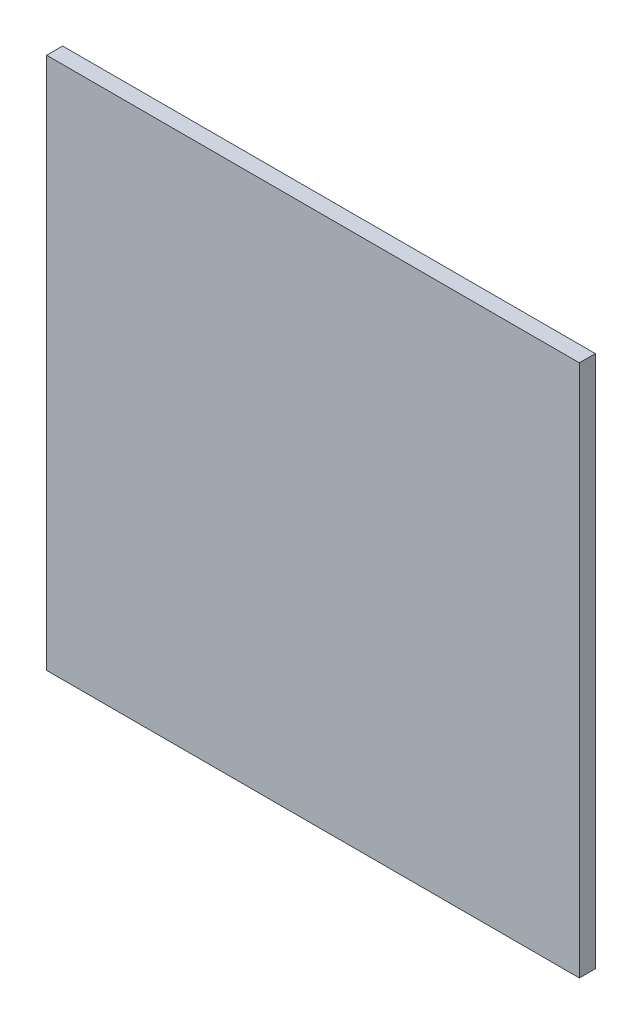
ISO-10303-21;
HEADER;
FILE_DESCRIPTION(('STEP AP214'),'2;1');
FILE_NAME('part.step','',(''),(''),'','','');
FILE_SCHEMA(('AUTOMOTIVE_DESIGN { 1 0 10303 214 1 1 1 1 }'));
ENDSEC;
DATA;
#1=APPLICATION_CONTEXT('core data for automotive mechanical design processes');
#2=APPLICATION_PROTOCOL_DEFINITION('international standard','automotive_design',2000,#1);
#3=PRODUCT_CONTEXT('',#1,'mechanical');
#4=PRODUCT('Part','Part','',(#3));
#5=PRODUCT_RELATED_PRODUCT_CATEGORY('part','',(#4));
#6=PRODUCT_DEFINITION_FORMATION('','',#4);
#7=PRODUCT_DEFINITION_CONTEXT('part definition',#1,'design');
#8=PRODUCT_DEFINITION('design','',#6,#7);
#9=PRODUCT_DEFINITION_SHAPE('','',#8);
#10=(LENGTH_UNIT() NAMED_UNIT(*) SI_UNIT(.MILLI.,.METRE.));
#11=(NAMED_UNIT(*) PLANE_ANGLE_UNIT() SI_UNIT($,.RADIAN.));
#12=(NAMED_UNIT(*) SI_UNIT($,.STERADIAN.) SOLID_ANGLE_UNIT());
#13=UNCERTAINTY_MEASURE_WITH_UNIT(LENGTH_MEASURE(1.E-05),#10,'distance_accuracy_value','');
#14=(GEOMETRIC_REPRESENTATION_CONTEXT(3) GLOBAL_UNCERTAINTY_ASSIGNED_CONTEXT((#13)) GLOBAL_UNIT_ASSIGNED_CONTEXT((#10,
#11,#12)) REPRESENTATION_CONTEXT('',''));
#15=CARTESIAN_POINT('',(0.,0.,0.));
#16=DIRECTION('',(0.,0.,1.));
#17=DIRECTION('',(1.,0.,0.));
#18=AXIS2_PLACEMENT_3D('',#15,#16,#17);
#19=CARTESIAN_POINT('',(73.9689060755339,-106.292457263354,3.));
#20=DIRECTION('',(0.,1.,0.));
#21=DIRECTION('',(-1.,0.,0.));
#22=AXIS2_PLACEMENT_3D('',#19,#20,#21);
#23=PLANE('',#22);
#24=DIRECTION('',(1.,0.,0.));
#25=VECTOR('',#24,1.);
#26=CARTESIAN_POINT('',(73.9689060755339,-106.292457263354,0.));
#27=LINE('',#26,#25);
#28=CARTESIAN_POINT('',(-26.0310939244661,-106.292457263354,0.));
#29=VERTEX_POINT('',#28);
#30=CARTESIAN_POINT('',(73.9689060755339,-106.292457263354,0.));
#31=VERTEX_POINT('',#30);
#32=EDGE_CURVE('E107',#29,#31,#27,.T.);
#33=ORIENTED_EDGE('',*,*,#32,.T.);
#34=DIRECTION('',(0.,0.,-1.));
#35=VECTOR('',#34,1.);
#36=CARTESIAN_POINT('',(73.9689060755339,-106.292457263354,3.));
#37=LINE('',#36,#35);
#38=CARTESIAN_POINT('',(73.9689060755339,-106.292457263354,3.));
#39=VERTEX_POINT('',#38);
#40=EDGE_CURVE('E11',#39,#31,#37,.T.);
#41=ORIENTED_EDGE('',*,*,#40,.F.);
#42=DIRECTION('',(1.,0.,0.));
#43=VECTOR('',#42,1.);
#44=CARTESIAN_POINT('',(73.9689060755339,-106.292457263354,3.));
#45=LINE('',#44,#43);
#46=CARTESIAN_POINT('',(-26.0310939244661,-106.292457263354,3.));
#47=VERTEX_POINT('',#46);
#48=EDGE_CURVE('E91',#47,#39,#45,.T.);
#49=ORIENTED_EDGE('',*,*,#48,.F.);
#50=DIRECTION('',(0.,0.,-1.));
#51=VECTOR('',#50,1.);
#52=CARTESIAN_POINT('',(-26.0310939244661,-106.292457263354,3.));
#53=LINE('',#52,#51);
#54=EDGE_CURVE('E103',#47,#29,#53,.T.);
#55=ORIENTED_EDGE('',*,*,#54,.T.);
#56=EDGE_LOOP('',(#33,#41,#49,#55));
#57=FACE_BOUND('',#56,.T.);
#58=ADVANCED_FACE('F39',(#57),#23,.F.);
#59=CARTESIAN_POINT('',(73.9689060755339,-6.29245726335448,3.));
#60=DIRECTION('',(-1.,0.,0.));
#61=DIRECTION('',(0.,-1.,0.));
#62=AXIS2_PLACEMENT_3D('',#59,#60,#61);
#63=PLANE('',#62);
#64=DIRECTION('',(0.,1.,0.));
#65=VECTOR('',#64,1.);
#66=CARTESIAN_POINT('',(73.9689060755339,-6.29245726335448,0.));
#67=LINE('',#66,#65);
#68=CARTESIAN_POINT('',(73.9689060755339,-6.29245726335448,0.));
#69=VERTEX_POINT('',#68);
#70=EDGE_CURVE('E96',#31,#69,#67,.T.);
#71=ORIENTED_EDGE('',*,*,#70,.T.);
#72=DIRECTION('',(0.,0.,-1.));
#73=VECTOR('',#72,1.);
#74=CARTESIAN_POINT('',(73.9689060755339,-6.29245726335448,3.));
#75=LINE('',#74,#73);
#76=CARTESIAN_POINT('',(73.9689060755339,-6.29245726335448,3.));
#77=VERTEX_POINT('',#76);
#78=EDGE_CURVE('E48',#77,#69,#75,.T.);
#79=ORIENTED_EDGE('',*,*,#78,.F.);
#80=DIRECTION('',(0.,1.,0.));
#81=VECTOR('',#80,1.);
#82=CARTESIAN_POINT('',(73.9689060755339,-6.29245726335448,3.));
#83=LINE('',#82,#81);
#84=EDGE_CURVE('E86',#39,#77,#83,.T.);
#85=ORIENTED_EDGE('',*,*,#84,.F.);
#86=ORIENTED_EDGE('',*,*,#40,.T.);
#87=EDGE_LOOP('',(#71,#79,#85,#86));
#88=FACE_BOUND('',#87,.T.);
#89=ADVANCED_FACE('F95',(#88),#63,.F.);
#90=CARTESIAN_POINT('',(-26.0310939244661,-6.29245726335448,3.));
#91=DIRECTION('',(0.,-1.,0.));
#92=DIRECTION('',(0.,0.,-1.));
#93=AXIS2_PLACEMENT_3D('',#90,#91,#92);
#94=PLANE('',#93);
#95=DIRECTION('',(-1.,0.,0.));
#96=VECTOR('',#95,1.);
#97=CARTESIAN_POINT('',(-26.0310939244661,-6.29245726335448,0.));
#98=LINE('',#97,#96);
#99=CARTESIAN_POINT('',(-26.0310939244661,-6.29245726335448,0.));
#100=VERTEX_POINT('',#99);
#101=EDGE_CURVE('E73',#69,#100,#98,.T.);
#102=ORIENTED_EDGE('',*,*,#101,.T.);
#103=DIRECTION('',(0.,0.,-1.));
#104=VECTOR('',#103,1.);
#105=CARTESIAN_POINT('',(-26.0310939244661,-6.29245726335448,3.));
#106=LINE('',#105,#104);
#107=CARTESIAN_POINT('',(-26.0310939244661,-6.29245726335448,3.));
#108=VERTEX_POINT('',#107);
#109=EDGE_CURVE('E98',#108,#100,#106,.T.);
#110=ORIENTED_EDGE('',*,*,#109,.F.);
#111=DIRECTION('',(-1.,0.,0.));
#112=VECTOR('',#111,1.);
#113=CARTESIAN_POINT('',(-26.0310939244661,-6.29245726335448,3.));
#114=LINE('',#113,#112);
#115=EDGE_CURVE('E89',#77,#108,#114,.T.);
#116=ORIENTED_EDGE('',*,*,#115,.F.);
#117=ORIENTED_EDGE('',*,*,#78,.T.);
#118=EDGE_LOOP('',(#102,#110,#116,#117));
#119=FACE_BOUND('',#118,.T.);
#120=ADVANCED_FACE('F99',(#119),#94,.F.);
#121=CARTESIAN_POINT('',(-26.0310939244661,-106.292457263354,3.));
#122=DIRECTION('',(1.,0.,0.));
#123=DIRECTION('',(0.,0.,-1.));
#124=AXIS2_PLACEMENT_3D('',#121,#122,#123);
#125=PLANE('',#124);
#126=DIRECTION('',(0.,-1.,0.));
#127=VECTOR('',#126,1.);
#128=CARTESIAN_POINT('',(-26.0310939244661,-106.292457263354,0.));
#129=LINE('',#128,#127);
#130=EDGE_CURVE('E79',#100,#29,#129,.T.);
#131=ORIENTED_EDGE('',*,*,#130,.T.);
#132=ORIENTED_EDGE('',*,*,#54,.F.);
#133=DIRECTION('',(0.,-1.,0.));
#134=VECTOR('',#133,1.);
#135=CARTESIAN_POINT('',(-26.0310939244661,-106.292457263354,3.));
#136=LINE('',#135,#134);
#137=EDGE_CURVE('E56',#108,#47,#136,.T.);
#138=ORIENTED_EDGE('',*,*,#137,.F.);
#139=ORIENTED_EDGE('',*,*,#109,.T.);
#140=EDGE_LOOP('',(#131,#132,#138,#139));
#141=FACE_BOUND('',#140,.T.);
#142=ADVANCED_FACE('F120',(#141),#125,.F.);
#143=CARTESIAN_POINT('',(0.,0.,3.));
#144=DIRECTION('',(0.,0.,-1.));
#145=DIRECTION('',(-1.,0.,0.));
#146=AXIS2_PLACEMENT_3D('',#143,#144,#145);
#147=PLANE('',#146);
#148=ORIENTED_EDGE('',*,*,#48,.T.);
#149=ORIENTED_EDGE('',*,*,#84,.T.);
#150=ORIENTED_EDGE('',*,*,#115,.T.);
#151=ORIENTED_EDGE('',*,*,#137,.T.);
#152=EDGE_LOOP('',(#148,#149,#150,#151));
#153=FACE_BOUND('',#152,.T.);
#154=ADVANCED_FACE('F87',(#153),#147,.F.);
#155=CARTESIAN_POINT('',(0.,0.,0.));
#156=DIRECTION('',(0.,0.,-1.));
#157=DIRECTION('',(-1.,0.,0.));
#158=AXIS2_PLACEMENT_3D('',#155,#156,#157);
#159=PLANE('',#158);
#160=ORIENTED_EDGE('',*,*,#32,.F.);
#161=ORIENTED_EDGE('',*,*,#130,.F.);
#162=ORIENTED_EDGE('',*,*,#101,.F.);
#163=ORIENTED_EDGE('',*,*,#70,.F.);
#164=EDGE_LOOP('',(#160,#161,#162,#163));
#165=FACE_BOUND('',#164,.T.);
#166=ADVANCED_FACE('F123',(#165),#159,.T.);
#167=CLOSED_SHELL('',(#58,#89,#120,#142,#154,#166));
#168=MANIFOLD_SOLID_BREP('B2',#167);
#169=ADVANCED_BREP_SHAPE_REPRESENTATION('',(#18,#168),#14);
#170=SHAPE_DEFINITION_REPRESENTATION(#9,#169);
ENDSEC;
END-ISO-10303-21;
